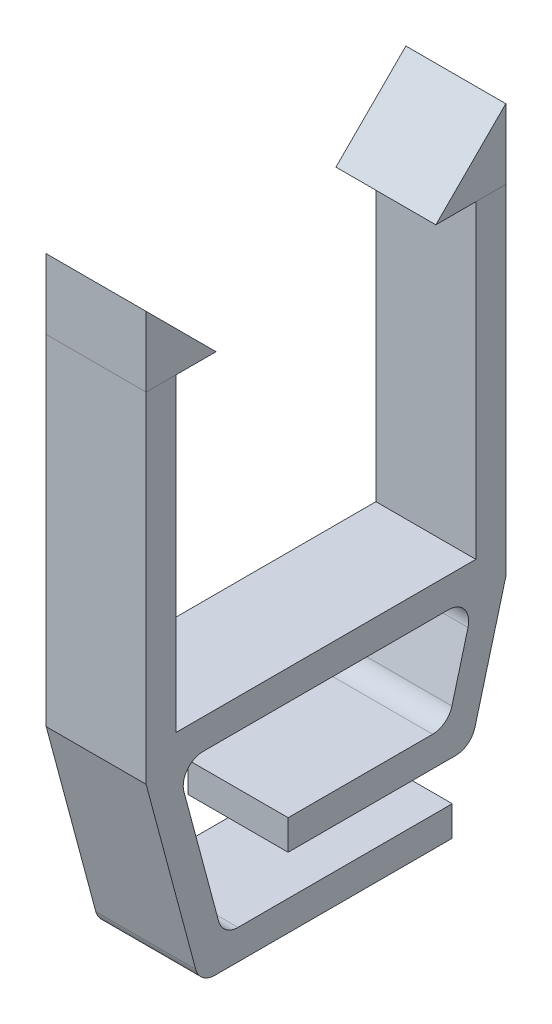
ISO-10303-21;
HEADER;
FILE_DESCRIPTION(('STEP AP214'),'2;1');
FILE_NAME('part.step','',(''),(''),'','','');
FILE_SCHEMA(('AUTOMOTIVE_DESIGN { 1 0 10303 214 1 1 1 1 }'));
ENDSEC;
DATA;
#1=APPLICATION_CONTEXT('core data for automotive mechanical design processes');
#2=APPLICATION_PROTOCOL_DEFINITION('international standard','automotive_design',2000,#1);
#3=PRODUCT_CONTEXT('',#1,'mechanical');
#4=PRODUCT('Part','Part','',(#3));
#5=PRODUCT_RELATED_PRODUCT_CATEGORY('part','',(#4));
#6=PRODUCT_DEFINITION_FORMATION('','',#4);
#7=PRODUCT_DEFINITION_CONTEXT('part definition',#1,'design');
#8=PRODUCT_DEFINITION('design','',#6,#7);
#9=PRODUCT_DEFINITION_SHAPE('','',#8);
#10=(LENGTH_UNIT() NAMED_UNIT(*) SI_UNIT(.MILLI.,.METRE.));
#11=(NAMED_UNIT(*) PLANE_ANGLE_UNIT() SI_UNIT($,.RADIAN.));
#12=(NAMED_UNIT(*) SI_UNIT($,.STERADIAN.) SOLID_ANGLE_UNIT());
#13=UNCERTAINTY_MEASURE_WITH_UNIT(LENGTH_MEASURE(1.E-05),#10,'distance_accuracy_value','');
#14=(GEOMETRIC_REPRESENTATION_CONTEXT(3) GLOBAL_UNCERTAINTY_ASSIGNED_CONTEXT((#13)) GLOBAL_UNIT_ASSIGNED_CONTEXT((#10,
#11,#12)) REPRESENTATION_CONTEXT('',''));
#15=CARTESIAN_POINT('',(0.,0.,0.));
#16=DIRECTION('',(0.,0.,1.));
#17=DIRECTION('',(1.,0.,0.));
#18=AXIS2_PLACEMENT_3D('',#15,#16,#17);
#19=CARTESIAN_POINT('',(-10.9756097560976,15.5,5.45121951219512));
#20=DIRECTION('',(0.,-1.,0.));
#21=DIRECTION('',(0.,0.,-1.));
#22=AXIS2_PLACEMENT_3D('',#19,#20,#21);
#23=PLANE('',#22);
#24=DIRECTION('',(0.,0.,-1.));
#25=VECTOR('',#24,1.);
#26=CARTESIAN_POINT('',(-5.97560975609756,15.5,5.45121951219512));
#27=LINE('',#26,#25);
#28=CARTESIAN_POINT('',(-5.97560975609756,15.5,8.95121951219512));
#29=VERTEX_POINT('',#28);
#30=CARTESIAN_POINT('',(-5.97560975609756,15.5,5.45121951219512));
#31=VERTEX_POINT('',#30);
#32=EDGE_CURVE('E100',#29,#31,#27,.T.);
#33=ORIENTED_EDGE('',*,*,#32,.F.);
#34=DIRECTION('',(1.,0.,0.));
#35=VECTOR('',#34,1.);
#36=CARTESIAN_POINT('',(-10.9756097560976,15.5,8.95121951219512));
#37=LINE('',#36,#35);
#38=CARTESIAN_POINT('',(-10.9756097560976,15.5,8.95121951219512));
#39=VERTEX_POINT('',#38);
#40=EDGE_CURVE('E12',#39,#29,#37,.T.);
#41=ORIENTED_EDGE('',*,*,#40,.F.);
#42=DIRECTION('',(0.,0.,-1.));
#43=VECTOR('',#42,1.);
#44=CARTESIAN_POINT('',(-10.9756097560976,15.5,5.45121951219512));
#45=LINE('',#44,#43);
#46=CARTESIAN_POINT('',(-10.9756097560976,15.5,5.45121951219512));
#47=VERTEX_POINT('',#46);
#48=EDGE_CURVE('E92',#39,#47,#45,.T.);
#49=ORIENTED_EDGE('',*,*,#48,.T.);
#50=DIRECTION('',(1.,0.,0.));
#51=VECTOR('',#50,1.);
#52=CARTESIAN_POINT('',(-10.9756097560976,15.5,5.45121951219512));
#53=LINE('',#52,#51);
#54=EDGE_CURVE('E51',#47,#31,#53,.T.);
#55=ORIENTED_EDGE('',*,*,#54,.T.);
#56=EDGE_LOOP('',(#33,#41,#49,#55));
#57=FACE_BOUND('',#56,.T.);
#58=ADVANCED_FACE('F48',(#57),#23,.T.);
#59=CARTESIAN_POINT('',(-10.9756097560976,15.5,8.95121951219512));
#60=DIRECTION('',(0.,0.,1.));
#61=DIRECTION('',(1.,0.,0.));
#62=AXIS2_PLACEMENT_3D('',#59,#60,#61);
#63=PLANE('',#62);
#64=DIRECTION('',(0.,-1.,0.));
#65=VECTOR('',#64,1.);
#66=CARTESIAN_POINT('',(-5.97560975609756,15.5,8.95121951219512));
#67=LINE('',#66,#65);
#68=CARTESIAN_POINT('',(-5.97560975609756,19.,8.95121951219512));
#69=VERTEX_POINT('',#68);
#70=EDGE_CURVE('E94',#69,#29,#67,.T.);
#71=ORIENTED_EDGE('',*,*,#70,.F.);
#72=DIRECTION('',(1.,0.,0.));
#73=VECTOR('',#72,1.);
#74=CARTESIAN_POINT('',(-10.9756097560976,19.,8.95121951219512));
#75=LINE('',#74,#73);
#76=CARTESIAN_POINT('',(-10.9756097560976,19.,8.95121951219512));
#77=VERTEX_POINT('',#76);
#78=EDGE_CURVE('E57',#77,#69,#75,.T.);
#79=ORIENTED_EDGE('',*,*,#78,.F.);
#80=DIRECTION('',(0.,-1.,0.));
#81=VECTOR('',#80,1.);
#82=CARTESIAN_POINT('',(-10.9756097560976,15.5,8.95121951219512));
#83=LINE('',#82,#81);
#84=EDGE_CURVE('E89',#77,#39,#83,.T.);
#85=ORIENTED_EDGE('',*,*,#84,.T.);
#86=ORIENTED_EDGE('',*,*,#40,.T.);
#87=EDGE_LOOP('',(#71,#79,#85,#86));
#88=FACE_BOUND('',#87,.T.);
#89=ADVANCED_FACE('F104',(#88),#63,.T.);
#90=CARTESIAN_POINT('',(-10.9756097560976,19.,8.95121951219512));
#91=DIRECTION('',(0.,0.707106781186548,-0.707106781186548));
#92=DIRECTION('',(0.,0.707106781186548,0.707106781186548));
#93=AXIS2_PLACEMENT_3D('',#90,#91,#92);
#94=PLANE('',#93);
#95=DIRECTION('',(0.,0.707106781186547,0.707106781186547));
#96=VECTOR('',#95,1.);
#97=CARTESIAN_POINT('',(-5.97560975609756,19.,8.95121951219512));
#98=LINE('',#97,#96);
#99=EDGE_CURVE('E87',#31,#69,#98,.T.);
#100=ORIENTED_EDGE('',*,*,#99,.F.);
#101=ORIENTED_EDGE('',*,*,#54,.F.);
#102=DIRECTION('',(0.,0.707106781186547,0.707106781186547));
#103=VECTOR('',#102,1.);
#104=CARTESIAN_POINT('',(-10.9756097560976,19.,8.95121951219512));
#105=LINE('',#104,#103);
#106=EDGE_CURVE('E85',#47,#77,#105,.T.);
#107=ORIENTED_EDGE('',*,*,#106,.T.);
#108=ORIENTED_EDGE('',*,*,#78,.T.);
#109=EDGE_LOOP('',(#100,#101,#107,#108));
#110=FACE_BOUND('',#109,.T.);
#111=ADVANCED_FACE('F84',(#110),#94,.T.);
#112=CARTESIAN_POINT('',(-10.9756097560976,0.,0.));
#113=DIRECTION('',(-1.,0.,0.));
#114=DIRECTION('',(0.,0.,1.));
#115=AXIS2_PLACEMENT_3D('',#112,#113,#114);
#116=PLANE('',#115);
#117=ORIENTED_EDGE('',*,*,#48,.F.);
#118=ORIENTED_EDGE('',*,*,#84,.F.);
#119=ORIENTED_EDGE('',*,*,#106,.F.);
#120=EDGE_LOOP('',(#117,#118,#119));
#121=FACE_BOUND('',#120,.T.);
#122=ADVANCED_FACE('F91',(#121),#116,.T.);
#123=CARTESIAN_POINT('',(-5.97560975609756,0.,0.));
#124=DIRECTION('',(-1.,0.,0.));
#125=DIRECTION('',(0.,0.,1.));
#126=AXIS2_PLACEMENT_3D('',#123,#124,#125);
#127=PLANE('',#126);
#128=ORIENTED_EDGE('',*,*,#32,.T.);
#129=ORIENTED_EDGE('',*,*,#99,.T.);
#130=ORIENTED_EDGE('',*,*,#70,.T.);
#131=EDGE_LOOP('',(#128,#129,#130));
#132=FACE_BOUND('',#131,.T.);
#133=ADVANCED_FACE('F103',(#132),#127,.F.);
#134=CLOSED_SHELL('',(#58,#89,#111,#122,#133));
#135=MANIFOLD_SOLID_BREP('B2',#134);
#136=CARTESIAN_POINT('',(-10.9756097560976,15.5,-5.54878048780488));
#137=DIRECTION('',(0.,-1.,0.));
#138=DIRECTION('',(0.,0.,-1.));
#139=AXIS2_PLACEMENT_3D('',#136,#137,#138);
#140=PLANE('',#139);
#141=DIRECTION('',(0.,0.,-1.));
#142=VECTOR('',#141,1.);
#143=CARTESIAN_POINT('',(-5.97560975609756,15.5,-5.54878048780488));
#144=LINE('',#143,#142);
#145=CARTESIAN_POINT('',(-5.97560975609756,15.5,-5.54878048780488));
#146=VERTEX_POINT('',#145);
#147=CARTESIAN_POINT('',(-5.97560975609756,15.5,-9.04878048780488));
#148=VERTEX_POINT('',#147);
#149=EDGE_CURVE('E207',#146,#148,#144,.T.);
#150=ORIENTED_EDGE('',*,*,#149,.F.);
#151=DIRECTION('',(1.,0.,0.));
#152=VECTOR('',#151,1.);
#153=CARTESIAN_POINT('',(-10.9756097560976,15.5,-5.54878048780488));
#154=LINE('',#153,#152);
#155=CARTESIAN_POINT('',(-10.9756097560976,15.5,-5.54878048780488));
#156=VERTEX_POINT('',#155);
#157=EDGE_CURVE('E46',#156,#146,#154,.T.);
#158=ORIENTED_EDGE('',*,*,#157,.F.);
#159=DIRECTION('',(0.,0.,-1.));
#160=VECTOR('',#159,1.);
#161=CARTESIAN_POINT('',(-10.9756097560976,15.5,-5.54878048780488));
#162=LINE('',#161,#160);
#163=CARTESIAN_POINT('',(-10.9756097560976,15.5,-9.04878048780488));
#164=VERTEX_POINT('',#163);
#165=EDGE_CURVE('E199',#156,#164,#162,.T.);
#166=ORIENTED_EDGE('',*,*,#165,.T.);
#167=DIRECTION('',(1.,0.,0.));
#168=VECTOR('',#167,1.);
#169=CARTESIAN_POINT('',(-10.9756097560976,15.5,-9.04878048780488));
#170=LINE('',#169,#168);
#171=EDGE_CURVE('E158',#164,#148,#170,.T.);
#172=ORIENTED_EDGE('',*,*,#171,.T.);
#173=EDGE_LOOP('',(#150,#158,#166,#172));
#174=FACE_BOUND('',#173,.T.);
#175=ADVANCED_FACE('F155',(#174),#140,.T.);
#176=CARTESIAN_POINT('',(-10.9756097560976,19.,-9.04878048780488));
#177=DIRECTION('',(0.,0.707106781186548,0.707106781186547));
#178=DIRECTION('',(0.,-0.707106781186547,0.707106781186548));
#179=AXIS2_PLACEMENT_3D('',#176,#177,#178);
#180=PLANE('',#179);
#181=DIRECTION('',(0.,-0.707106781186547,0.707106781186548));
#182=VECTOR('',#181,1.);
#183=CARTESIAN_POINT('',(-5.97560975609756,19.,-9.04878048780489));
#184=LINE('',#183,#182);
#185=CARTESIAN_POINT('',(-5.97560975609756,19.,-9.04878048780489));
#186=VERTEX_POINT('',#185);
#187=EDGE_CURVE('E201',#186,#146,#184,.T.);
#188=ORIENTED_EDGE('',*,*,#187,.F.);
#189=DIRECTION('',(1.,0.,0.));
#190=VECTOR('',#189,1.);
#191=CARTESIAN_POINT('',(-10.9756097560976,19.,-9.04878048780488));
#192=LINE('',#191,#190);
#193=CARTESIAN_POINT('',(-10.9756097560976,19.,-9.04878048780488));
#194=VERTEX_POINT('',#193);
#195=EDGE_CURVE('E164',#194,#186,#192,.T.);
#196=ORIENTED_EDGE('',*,*,#195,.F.);
#197=DIRECTION('',(0.,-0.707106781186547,0.707106781186548));
#198=VECTOR('',#197,1.);
#199=CARTESIAN_POINT('',(-10.9756097560976,19.,-9.04878048780488));
#200=LINE('',#199,#198);
#201=EDGE_CURVE('E196',#194,#156,#200,.T.);
#202=ORIENTED_EDGE('',*,*,#201,.T.);
#203=ORIENTED_EDGE('',*,*,#157,.T.);
#204=EDGE_LOOP('',(#188,#196,#202,#203));
#205=FACE_BOUND('',#204,.T.);
#206=ADVANCED_FACE('F211',(#205),#180,.T.);
#207=CARTESIAN_POINT('',(-10.9756097560976,15.5,-9.04878048780488));
#208=DIRECTION('',(0.,0.,-1.));
#209=DIRECTION('',(0.,1.,0.));
#210=AXIS2_PLACEMENT_3D('',#207,#208,#209);
#211=PLANE('',#210);
#212=DIRECTION('',(0.,1.,0.));
#213=VECTOR('',#212,1.);
#214=CARTESIAN_POINT('',(-5.97560975609756,15.5,-9.04878048780488));
#215=LINE('',#214,#213);
#216=EDGE_CURVE('E194',#148,#186,#215,.T.);
#217=ORIENTED_EDGE('',*,*,#216,.F.);
#218=ORIENTED_EDGE('',*,*,#171,.F.);
#219=DIRECTION('',(0.,1.,0.));
#220=VECTOR('',#219,1.);
#221=CARTESIAN_POINT('',(-10.9756097560976,15.5,-9.04878048780488));
#222=LINE('',#221,#220);
#223=EDGE_CURVE('E192',#164,#194,#222,.T.);
#224=ORIENTED_EDGE('',*,*,#223,.T.);
#225=ORIENTED_EDGE('',*,*,#195,.T.);
#226=EDGE_LOOP('',(#217,#218,#224,#225));
#227=FACE_BOUND('',#226,.T.);
#228=ADVANCED_FACE('F191',(#227),#211,.T.);
#229=CARTESIAN_POINT('',(-10.9756097560976,0.,0.));
#230=DIRECTION('',(1.,0.,0.));
#231=DIRECTION('',(0.,0.,-1.));
#232=AXIS2_PLACEMENT_3D('',#229,#230,#231);
#233=PLANE('',#232);
#234=ORIENTED_EDGE('',*,*,#165,.F.);
#235=ORIENTED_EDGE('',*,*,#201,.F.);
#236=ORIENTED_EDGE('',*,*,#223,.F.);
#237=EDGE_LOOP('',(#234,#235,#236));
#238=FACE_BOUND('',#237,.T.);
#239=ADVANCED_FACE('F198',(#238),#233,.F.);
#240=CARTESIAN_POINT('',(-5.97560975609756,0.,0.));
#241=DIRECTION('',(1.,0.,0.));
#242=DIRECTION('',(0.,0.,-1.));
#243=AXIS2_PLACEMENT_3D('',#240,#241,#242);
#244=PLANE('',#243);
#245=ORIENTED_EDGE('',*,*,#149,.T.);
#246=ORIENTED_EDGE('',*,*,#216,.T.);
#247=ORIENTED_EDGE('',*,*,#187,.T.);
#248=EDGE_LOOP('',(#245,#246,#247));
#249=FACE_BOUND('',#248,.T.);
#250=ADVANCED_FACE('F210',(#249),#244,.T.);
#251=CLOSED_SHELL('',(#175,#206,#228,#239,#250));
#252=MANIFOLD_SOLID_BREP('B6',#251);
#253=CARTESIAN_POINT('',(0.,-1.5,0.));
#254=DIRECTION('',(0.,1.,0.));
#255=DIRECTION('',(0.,0.,1.));
#256=AXIS2_PLACEMENT_3D('',#253,#254,#255);
#257=PLANE('',#256);
#258=DIRECTION('',(0.,0.,1.));
#259=VECTOR('',#258,1.);
#260=CARTESIAN_POINT('',(-5.97560975609756,-1.5,8.95121951219512));
#261=LINE('',#260,#259);
#262=CARTESIAN_POINT('',(-5.97560975609755,-1.5,-6.19264084434854));
#263=VERTEX_POINT('',#262);
#264=CARTESIAN_POINT('',(-5.97560975609756,-1.5,6.09507986873879));
#265=VERTEX_POINT('',#264);
#266=EDGE_CURVE('E509',#263,#265,#261,.T.);
#267=ORIENTED_EDGE('',*,*,#266,.T.);
#268=DIRECTION('',(1.,0.,0.));
#269=VECTOR('',#268,1.);
#270=CARTESIAN_POINT('',(0.,-1.5,6.09507986873879));
#271=LINE('',#270,#269);
#272=CARTESIAN_POINT('',(-10.9756097560976,-1.5,6.09507986873879));
#273=VERTEX_POINT('',#272);
#274=EDGE_CURVE('E590',#265,#273,#271,.F.);
#275=ORIENTED_EDGE('',*,*,#274,.T.);
#276=DIRECTION('',(0.,0.,-1.));
#277=VECTOR('',#276,1.);
#278=CARTESIAN_POINT('',(-10.9756097560976,-1.5,8.95121951219512));
#279=LINE('',#278,#277);
#280=CARTESIAN_POINT('',(-10.9756097560976,-1.5,-6.19264084434854));
#281=VERTEX_POINT('',#280);
#282=EDGE_CURVE('E516',#273,#281,#279,.T.);
#283=ORIENTED_EDGE('',*,*,#282,.T.);
#284=DIRECTION('',(1.,0.,0.));
#285=VECTOR('',#284,1.);
#286=CARTESIAN_POINT('',(0.,-1.5,-6.19264084434855));
#287=LINE('',#286,#285);
#288=EDGE_CURVE('E587',#281,#263,#287,.T.);
#289=ORIENTED_EDGE('',*,*,#288,.T.);
#290=EDGE_LOOP('',(#267,#275,#283,#289));
#291=FACE_BOUND('',#290,.T.);
#292=ADVANCED_FACE('F253',(#291),#257,.F.);
#293=CARTESIAN_POINT('',(-10.9756097560976,15.5,0.));
#294=DIRECTION('',(1.,0.,0.));
#295=DIRECTION('',(0.,0.,-1.));
#296=AXIS2_PLACEMENT_3D('',#293,#294,#295);
#297=PLANE('',#296);
#298=DIRECTION('',(0.,0.,-1.));
#299=VECTOR('',#298,1.);
#300=CARTESIAN_POINT('',(-10.9756097560976,-11.5,6.27172758788392));
#301=LINE('',#300,#299);
#302=CARTESIAN_POINT('',(-10.9756097560976,-11.5,5.50440059990496));
#303=VERTEX_POINT('',#302);
#304=CARTESIAN_POINT('',(-10.9756097560976,-11.5,-6.36928856349361));
#305=VERTEX_POINT('',#304);
#306=EDGE_CURVE('E462',#303,#305,#301,.T.);
#307=ORIENTED_EDGE('',*,*,#306,.F.);
#308=CARTESIAN_POINT('',(-10.9756097560976,-10.5,5.50440059990496));
#309=DIRECTION('',(1.,0.,0.));
#310=DIRECTION('',(0.,0.,-1.));
#311=AXIS2_PLACEMENT_3D('',#308,#309,#310);
#312=CIRCLE('',#311,1.);
#313=CARTESIAN_POINT('',(-10.9756097560976,-10.7588190451025,6.47032642619403));
#314=VERTEX_POINT('',#313);
#315=EDGE_CURVE('E566',#303,#314,#312,.F.);
#316=ORIENTED_EDGE('',*,*,#315,.T.);
#317=DIRECTION('',(0.,-0.965925826289069,-0.258819045102518));
#318=VECTOR('',#317,1.);
#319=CARTESIAN_POINT('',(-10.9756097560976,-1.5,8.95121951219512));
#320=LINE('',#319,#318);
#321=CARTESIAN_POINT('',(-10.9756097560976,-1.5,8.95121951219512));
#322=VERTEX_POINT('',#321);
#323=EDGE_CURVE('E459',#322,#314,#320,.T.);
#324=ORIENTED_EDGE('',*,*,#323,.F.);
#325=DIRECTION('',(0.,1.,0.));
#326=VECTOR('',#325,1.);
#327=CARTESIAN_POINT('',(-10.9756097560976,-1.5,8.95121951219512));
#328=LINE('',#327,#326);
#329=CARTESIAN_POINT('',(-10.9756097560976,15.5,8.95121951219512));
#330=VERTEX_POINT('',#329);
#331=EDGE_CURVE('E522',#322,#330,#328,.T.);
#332=ORIENTED_EDGE('',*,*,#331,.T.);
#333=DIRECTION('',(0.,0.,1.));
#334=VECTOR('',#333,1.);
#335=CARTESIAN_POINT('',(-10.9756097560976,15.5,0.));
#336=LINE('',#335,#334);
#337=CARTESIAN_POINT('',(-10.9756097560976,15.5,7.45121951219512));
#338=VERTEX_POINT('',#337);
#339=EDGE_CURVE('E493',#338,#330,#336,.T.);
#340=ORIENTED_EDGE('',*,*,#339,.F.);
#341=DIRECTION('',(0.,-1.,0.));
#342=VECTOR('',#341,1.);
#343=CARTESIAN_POINT('',(-10.9756097560976,15.5,7.45121951219512));
#344=LINE('',#343,#342);
#345=CARTESIAN_POINT('',(-10.9756097560976,0.,7.45121951219512));
#346=VERTEX_POINT('',#345);
#347=EDGE_CURVE('E506',#338,#346,#344,.T.);
#348=ORIENTED_EDGE('',*,*,#347,.T.);
#349=DIRECTION('',(0.,0.,-1.));
#350=VECTOR('',#349,1.);
#351=CARTESIAN_POINT('',(-10.9756097560976,0.,8.95121951219512));
#352=LINE('',#351,#350);
#353=CARTESIAN_POINT('',(-10.9756097560976,0.,-7.54878048780489));
#354=VERTEX_POINT('',#353);
#355=EDGE_CURVE('E513',#346,#354,#352,.T.);
#356=ORIENTED_EDGE('',*,*,#355,.T.);
#357=DIRECTION('',(0.,-1.,0.));
#358=VECTOR('',#357,1.);
#359=CARTESIAN_POINT('',(-10.9756097560976,15.5,-7.54878048780488));
#360=LINE('',#359,#358);
#361=CARTESIAN_POINT('',(-10.9756097560976,15.5,-7.54878048780488));
#362=VERTEX_POINT('',#361);
#363=EDGE_CURVE('E552',#362,#354,#360,.T.);
#364=ORIENTED_EDGE('',*,*,#363,.F.);
#365=DIRECTION('',(0.,0.,1.));
#366=VECTOR('',#365,1.);
#367=CARTESIAN_POINT('',(-10.9756097560976,15.5,0.));
#368=LINE('',#367,#366);
#369=CARTESIAN_POINT('',(-10.9756097560976,15.5,-9.04878048780488));
#370=VERTEX_POINT('',#369);
#371=EDGE_CURVE('E530',#370,#362,#368,.T.);
#372=ORIENTED_EDGE('',*,*,#371,.F.);
#373=DIRECTION('',(0.,-1.,0.));
#374=VECTOR('',#373,1.);
#375=CARTESIAN_POINT('',(-10.9756097560976,15.5,-9.04878048780488));
#376=LINE('',#375,#374);
#377=CARTESIAN_POINT('',(-10.9756097560976,-1.5,-9.04878048780488));
#378=VERTEX_POINT('',#377);
#379=EDGE_CURVE('E541',#370,#378,#376,.T.);
#380=ORIENTED_EDGE('',*,*,#379,.T.);
#381=DIRECTION('',(0.,0.965925826289067,-0.258819045102524));
#382=VECTOR('',#381,1.);
#383=CARTESIAN_POINT('',(-10.9756097560976,-1.5,-9.04878048780488));
#384=LINE('',#383,#382);
#385=CARTESIAN_POINT('',(-10.9756097560976,-7.25881904510253,-7.50570957531266));
#386=VERTEX_POINT('',#385);
#387=EDGE_CURVE('E434',#386,#378,#384,.T.);
#388=ORIENTED_EDGE('',*,*,#387,.F.);
#389=CARTESIAN_POINT('',(-10.9756097560976,-7.,-6.5397837490236));
#390=DIRECTION('',(1.,0.,0.));
#391=DIRECTION('',(0.,0.,-1.));
#392=AXIS2_PLACEMENT_3D('',#389,#390,#391);
#393=CIRCLE('',#392,1.);
#394=CARTESIAN_POINT('',(-10.9756097560976,-8.,-6.5397837490236));
#395=VERTEX_POINT('',#394);
#396=EDGE_CURVE('E564',#386,#395,#393,.F.);
#397=ORIENTED_EDGE('',*,*,#396,.T.);
#398=DIRECTION('',(0.,0.,-1.));
#399=VECTOR('',#398,1.);
#400=CARTESIAN_POINT('',(-10.9756097560976,-8.,-7.30711073700255));
#401=LINE('',#400,#399);
#402=CARTESIAN_POINT('',(-10.9756097560976,-8.,1.84387974496588));
#403=VERTEX_POINT('',#402);
#404=EDGE_CURVE('E440',#403,#395,#401,.T.);
#405=ORIENTED_EDGE('',*,*,#404,.F.);
#406=DIRECTION('',(0.,-1.,0.));
#407=VECTOR('',#406,1.);
#408=CARTESIAN_POINT('',(-10.9756097560976,-8.,1.84387974496588));
#409=LINE('',#408,#407);
#410=CARTESIAN_POINT('',(-10.9756097560976,-6.5,1.84387974496588));
#411=VERTEX_POINT('',#410);
#412=EDGE_CURVE('E425',#411,#403,#409,.T.);
#413=ORIENTED_EDGE('',*,*,#412,.F.);
#414=DIRECTION('',(0.,0.,1.));
#415=VECTOR('',#414,1.);
#416=CARTESIAN_POINT('',(-10.9756097560976,-6.5,1.84387974496588));
#417=LINE('',#416,#415);
#418=CARTESIAN_POINT('',(-10.9756097560976,-6.5,-5.38879326705516));
#419=VERTEX_POINT('',#418);
#420=EDGE_CURVE('E415',#419,#411,#417,.T.);
#421=ORIENTED_EDGE('',*,*,#420,.F.);
#422=CARTESIAN_POINT('',(-10.9756097560976,-5.5,-5.38879326705516));
#423=DIRECTION('',(1.,0.,0.));
#424=DIRECTION('',(0.,0.,-1.));
#425=AXIS2_PLACEMENT_3D('',#422,#423,#424);
#426=CIRCLE('',#425,1.);
#427=CARTESIAN_POINT('',(-10.9756097560976,-5.75881904510253,-6.35471909334423));
#428=VERTEX_POINT('',#427);
#429=EDGE_CURVE('E597',#419,#428,#426,.T.);
#430=ORIENTED_EDGE('',*,*,#429,.T.);
#431=DIRECTION('',(0.,-0.965925826289067,0.258819045102525));
#432=VECTOR('',#431,1.);
#433=CARTESIAN_POINT('',(-10.9756097560976,-6.5,-6.15612025503412));
#434=LINE('',#433,#432);
#435=CARTESIAN_POINT('',(-10.9756097560976,-2.75881904510252,-7.15856667063761));
#436=VERTEX_POINT('',#435);
#437=EDGE_CURVE('E426',#436,#428,#434,.T.);
#438=ORIENTED_EDGE('',*,*,#437,.F.);
#439=CARTESIAN_POINT('',(-10.9756097560976,-2.5,-6.19264084434854));
#440=DIRECTION('',(1.,0.,0.));
#441=DIRECTION('',(0.,0.,-1.));
#442=AXIS2_PLACEMENT_3D('',#439,#440,#441);
#443=CIRCLE('',#442,1.);
#444=EDGE_CURVE('E153',#436,#281,#443,.T.);
#445=ORIENTED_EDGE('',*,*,#444,.T.);
#446=ORIENTED_EDGE('',*,*,#282,.F.);
#447=CARTESIAN_POINT('',(-10.9756097560976,-2.5,6.09507986873879));
#448=DIRECTION('',(1.,0.,0.));
#449=DIRECTION('',(0.,0.,-1.));
#450=AXIS2_PLACEMENT_3D('',#447,#448,#449);
#451=CIRCLE('',#450,1.);
#452=CARTESIAN_POINT('',(-10.9756097560976,-2.75881904510252,7.06100569502786));
#453=VERTEX_POINT('',#452);
#454=EDGE_CURVE('E274',#273,#453,#451,.T.);
#455=ORIENTED_EDGE('',*,*,#454,.T.);
#456=DIRECTION('',(0.,0.965925826289069,0.258819045102518));
#457=VECTOR('',#456,1.);
#458=CARTESIAN_POINT('',(-10.9756097560976,-10.,5.12073710591548));
#459=LINE('',#458,#457);
#460=CARTESIAN_POINT('',(-10.9756097560976,-9.25881904510252,5.31933594422558));
#461=VERTEX_POINT('',#460);
#462=EDGE_CURVE('E470',#461,#453,#459,.T.);
#463=ORIENTED_EDGE('',*,*,#462,.F.);
#464=CARTESIAN_POINT('',(-10.9756097560976,-9.,4.35341011793651));
#465=DIRECTION('',(1.,0.,0.));
#466=DIRECTION('',(0.,0.,-1.));
#467=AXIS2_PLACEMENT_3D('',#464,#465,#466);
#468=CIRCLE('',#467,1.);
#469=CARTESIAN_POINT('',(-10.9756097560976,-10.,4.35341011793651));
#470=VERTEX_POINT('',#469);
#471=EDGE_CURVE('E268',#461,#470,#468,.T.);
#472=ORIENTED_EDGE('',*,*,#471,.T.);
#473=DIRECTION('',(0.,0.,1.));
#474=VECTOR('',#473,1.);
#475=CARTESIAN_POINT('',(-10.9756097560976,-10.,-6.36928856349361));
#476=LINE('',#475,#474);
#477=CARTESIAN_POINT('',(-10.9756097560976,-10.,-6.36928856349361));
#478=VERTEX_POINT('',#477);
#479=EDGE_CURVE('E468',#478,#470,#476,.T.);
#480=ORIENTED_EDGE('',*,*,#479,.F.);
#481=DIRECTION('',(0.,1.,0.));
#482=VECTOR('',#481,1.);
#483=CARTESIAN_POINT('',(-10.9756097560976,-11.5,-6.36928856349361));
#484=LINE('',#483,#482);
#485=EDGE_CURVE('E465',#305,#478,#484,.T.);
#486=ORIENTED_EDGE('',*,*,#485,.F.);
#487=EDGE_LOOP('',(#307,#316,#324,#332,#340,#348,#356,#364,#372,#380,#388,#397,#405,#413,#421,
#430,#438,#445,#446,#455,#463,#472,#480,#486));
#488=FACE_BOUND('',#487,.T.);
#489=ADVANCED_FACE('F438',(#488),#297,.F.);
#490=CARTESIAN_POINT('',(0.,15.5,-7.54878048780488));
#491=DIRECTION('',(0.,0.,-1.));
#492=DIRECTION('',(-1.,0.,0.));
#493=AXIS2_PLACEMENT_3D('',#490,#491,#492);
#494=PLANE('',#493);
#495=DIRECTION('',(1.,0.,0.));
#496=VECTOR('',#495,1.);
#497=CARTESIAN_POINT('',(0.,0.,-7.54878048780488));
#498=LINE('',#497,#496);
#499=CARTESIAN_POINT('',(-5.97560975609756,0.,-7.54878048780488));
#500=VERTEX_POINT('',#499);
#501=EDGE_CURVE('E529',#354,#500,#498,.T.);
#502=ORIENTED_EDGE('',*,*,#501,.T.);
#503=DIRECTION('',(0.,-1.,0.));
#504=VECTOR('',#503,1.);
#505=CARTESIAN_POINT('',(-5.97560975609756,15.5,-7.54878048780488));
#506=LINE('',#505,#504);
#507=CARTESIAN_POINT('',(-5.97560975609756,15.5,-7.54878048780488));
#508=VERTEX_POINT('',#507);
#509=EDGE_CURVE('E549',#508,#500,#506,.T.);
#510=ORIENTED_EDGE('',*,*,#509,.F.);
#511=DIRECTION('',(1.,0.,0.));
#512=VECTOR('',#511,1.);
#513=CARTESIAN_POINT('',(0.,15.5,-7.54878048780488));
#514=LINE('',#513,#512);
#515=EDGE_CURVE('E533',#362,#508,#514,.T.);
#516=ORIENTED_EDGE('',*,*,#515,.F.);
#517=ORIENTED_EDGE('',*,*,#363,.T.);
#518=EDGE_LOOP('',(#502,#510,#516,#517));
#519=FACE_BOUND('',#518,.T.);
#520=ADVANCED_FACE('F665',(#519),#494,.F.);
#521=CARTESIAN_POINT('',(-5.97560975609756,15.5,0.));
#522=DIRECTION('',(1.,0.,0.));
#523=DIRECTION('',(0.,0.,-1.));
#524=AXIS2_PLACEMENT_3D('',#521,#522,#523);
#525=PLANE('',#524);
#526=DIRECTION('',(0.,-0.965925826289069,-0.258819045102518));
#527=VECTOR('',#526,1.);
#528=CARTESIAN_POINT('',(-5.97560975609756,-1.5,8.95121951219512));
#529=LINE('',#528,#527);
#530=CARTESIAN_POINT('',(-5.97560975609756,-1.5,8.95121951219512));
#531=VERTEX_POINT('',#530);
#532=CARTESIAN_POINT('',(-5.97560975609756,-10.7588190451025,6.47032642619403));
#533=VERTEX_POINT('',#532);
#534=EDGE_CURVE('E457',#531,#533,#529,.T.);
#535=ORIENTED_EDGE('',*,*,#534,.T.);
#536=CARTESIAN_POINT('',(-5.97560975609756,-10.5,5.50440059990496));
#537=DIRECTION('',(1.,0.,0.));
#538=DIRECTION('',(0.,0.,-1.));
#539=AXIS2_PLACEMENT_3D('',#536,#537,#538);
#540=CIRCLE('',#539,1.);
#541=CARTESIAN_POINT('',(-5.97560975609756,-11.5,5.50440059990496));
#542=VERTEX_POINT('',#541);
#543=EDGE_CURVE('E560',#533,#542,#540,.T.);
#544=ORIENTED_EDGE('',*,*,#543,.T.);
#545=DIRECTION('',(0.,0.,-1.));
#546=VECTOR('',#545,1.);
#547=CARTESIAN_POINT('',(-5.97560975609756,-11.5,6.27172758788392));
#548=LINE('',#547,#546);
#549=CARTESIAN_POINT('',(-5.97560975609756,-11.5,-6.36928856349361));
#550=VERTEX_POINT('',#549);
#551=EDGE_CURVE('E475',#542,#550,#548,.T.);
#552=ORIENTED_EDGE('',*,*,#551,.T.);
#553=DIRECTION('',(0.,1.,0.));
#554=VECTOR('',#553,1.);
#555=CARTESIAN_POINT('',(-5.97560975609756,-11.5,-6.36928856349361));
#556=LINE('',#555,#554);
#557=CARTESIAN_POINT('',(-5.97560975609756,-10.,-6.36928856349361));
#558=VERTEX_POINT('',#557);
#559=EDGE_CURVE('E477',#550,#558,#556,.T.);
#560=ORIENTED_EDGE('',*,*,#559,.T.);
#561=DIRECTION('',(0.,0.,1.));
#562=VECTOR('',#561,1.);
#563=CARTESIAN_POINT('',(-5.97560975609756,-10.,-6.36928856349361));
#564=LINE('',#563,#562);
#565=CARTESIAN_POINT('',(-5.97560975609756,-10.,4.35341011793651));
#566=VERTEX_POINT('',#565);
#567=EDGE_CURVE('E480',#558,#566,#564,.T.);
#568=ORIENTED_EDGE('',*,*,#567,.T.);
#569=CARTESIAN_POINT('',(-5.97560975609756,-9.,4.35341011793651));
#570=DIRECTION('',(1.,0.,0.));
#571=DIRECTION('',(0.,0.,-1.));
#572=AXIS2_PLACEMENT_3D('',#569,#570,#571);
#573=CIRCLE('',#572,1.);
#574=CARTESIAN_POINT('',(-5.97560975609756,-9.25881904510252,5.31933594422558));
#575=VERTEX_POINT('',#574);
#576=EDGE_CURVE('E592',#566,#575,#573,.F.);
#577=ORIENTED_EDGE('',*,*,#576,.T.);
#578=DIRECTION('',(0.,0.965925826289069,0.258819045102518));
#579=VECTOR('',#578,1.);
#580=CARTESIAN_POINT('',(-5.97560975609756,-10.,5.12073710591548));
#581=LINE('',#580,#579);
#582=CARTESIAN_POINT('',(-5.97560975609756,-2.75881904510252,7.06100569502786));
#583=VERTEX_POINT('',#582);
#584=EDGE_CURVE('E463',#575,#583,#581,.T.);
#585=ORIENTED_EDGE('',*,*,#584,.T.);
#586=CARTESIAN_POINT('',(-5.97560975609756,-2.5,6.09507986873879));
#587=DIRECTION('',(1.,0.,0.));
#588=DIRECTION('',(0.,0.,-1.));
#589=AXIS2_PLACEMENT_3D('',#586,#587,#588);
#590=CIRCLE('',#589,1.);
#591=EDGE_CURVE('E599',#583,#265,#590,.F.);
#592=ORIENTED_EDGE('',*,*,#591,.T.);
#593=ORIENTED_EDGE('',*,*,#266,.F.);
#594=CARTESIAN_POINT('',(-5.97560975609756,-2.5,-6.19264084434854));
#595=DIRECTION('',(1.,0.,0.));
#596=DIRECTION('',(0.,0.,-1.));
#597=AXIS2_PLACEMENT_3D('',#594,#595,#596);
#598=CIRCLE('',#597,1.);
#599=CARTESIAN_POINT('',(-5.97560975609756,-2.75881904510252,-7.15856667063761));
#600=VERTEX_POINT('',#599);
#601=EDGE_CURVE('E261',#263,#600,#598,.F.);
#602=ORIENTED_EDGE('',*,*,#601,.T.);
#603=DIRECTION('',(0.,-0.965925826289067,0.258819045102525));
#604=VECTOR('',#603,1.);
#605=CARTESIAN_POINT('',(-5.97560975609756,-6.5,-6.15612025503412));
#606=LINE('',#605,#604);
#607=CARTESIAN_POINT('',(-5.97560975609756,-5.75881904510253,-6.35471909334423));
#608=VERTEX_POINT('',#607);
#609=EDGE_CURVE('E446',#600,#608,#606,.T.);
#610=ORIENTED_EDGE('',*,*,#609,.T.);
#611=CARTESIAN_POINT('',(-5.97560975609756,-5.5,-5.38879326705516));
#612=DIRECTION('',(1.,0.,0.));
#613=DIRECTION('',(0.,0.,-1.));
#614=AXIS2_PLACEMENT_3D('',#611,#612,#613);
#615=CIRCLE('',#614,1.);
#616=CARTESIAN_POINT('',(-5.97560975609756,-6.5,-5.38879326705516));
#617=VERTEX_POINT('',#616);
#618=EDGE_CURVE('E595',#608,#617,#615,.F.);
#619=ORIENTED_EDGE('',*,*,#618,.T.);
#620=DIRECTION('',(0.,0.,1.));
#621=VECTOR('',#620,1.);
#622=CARTESIAN_POINT('',(-5.97560975609756,-6.5,1.84387974496588));
#623=LINE('',#622,#621);
#624=CARTESIAN_POINT('',(-5.97560975609756,-6.5,1.84387974496588));
#625=VERTEX_POINT('',#624);
#626=EDGE_CURVE('E449',#617,#625,#623,.T.);
#627=ORIENTED_EDGE('',*,*,#626,.T.);
#628=DIRECTION('',(0.,-1.,0.));
#629=VECTOR('',#628,1.);
#630=CARTESIAN_POINT('',(-5.97560975609756,-8.,1.84387974496588));
#631=LINE('',#630,#629);
#632=CARTESIAN_POINT('',(-5.97560975609756,-8.,1.84387974496588));
#633=VERTEX_POINT('',#632);
#634=EDGE_CURVE('E432',#625,#633,#631,.T.);
#635=ORIENTED_EDGE('',*,*,#634,.T.);
#636=DIRECTION('',(0.,0.,-1.));
#637=VECTOR('',#636,1.);
#638=CARTESIAN_POINT('',(-5.97560975609756,-8.,-7.30711073700256));
#639=LINE('',#638,#637);
#640=CARTESIAN_POINT('',(-5.97560975609756,-8.,-6.5397837490236));
#641=VERTEX_POINT('',#640);
#642=EDGE_CURVE('E452',#633,#641,#639,.T.);
#643=ORIENTED_EDGE('',*,*,#642,.T.);
#644=CARTESIAN_POINT('',(-5.97560975609756,-7.,-6.5397837490236));
#645=DIRECTION('',(1.,0.,0.));
#646=DIRECTION('',(0.,0.,-1.));
#647=AXIS2_PLACEMENT_3D('',#644,#645,#646);
#648=CIRCLE('',#647,1.);
#649=CARTESIAN_POINT('',(-5.97560975609756,-7.25881904510253,-7.50570957531267));
#650=VERTEX_POINT('',#649);
#651=EDGE_CURVE('E558',#641,#650,#648,.T.);
#652=ORIENTED_EDGE('',*,*,#651,.T.);
#653=DIRECTION('',(0.,0.965925826289067,-0.258819045102524));
#654=VECTOR('',#653,1.);
#655=CARTESIAN_POINT('',(-5.97560975609756,-1.5,-9.04878048780488));
#656=LINE('',#655,#654);
#657=CARTESIAN_POINT('',(-5.97560975609756,-1.5,-9.04878048780488));
#658=VERTEX_POINT('',#657);
#659=EDGE_CURVE('E455',#650,#658,#656,.T.);
#660=ORIENTED_EDGE('',*,*,#659,.T.);
#661=DIRECTION('',(0.,-1.,0.));
#662=VECTOR('',#661,1.);
#663=CARTESIAN_POINT('',(-5.97560975609756,15.5,-9.04878048780488));
#664=LINE('',#663,#662);
#665=CARTESIAN_POINT('',(-5.97560975609756,15.5,-9.04878048780488));
#666=VERTEX_POINT('',#665);
#667=EDGE_CURVE('E546',#666,#658,#664,.T.);
#668=ORIENTED_EDGE('',*,*,#667,.F.);
#669=DIRECTION('',(0.,0.,1.));
#670=VECTOR('',#669,1.);
#671=CARTESIAN_POINT('',(-5.97560975609756,15.5,0.));
#672=LINE('',#671,#670);
#673=EDGE_CURVE('E535',#666,#508,#672,.T.);
#674=ORIENTED_EDGE('',*,*,#673,.T.);
#675=ORIENTED_EDGE('',*,*,#509,.T.);
#676=DIRECTION('',(0.,0.,1.));
#677=VECTOR('',#676,1.);
#678=CARTESIAN_POINT('',(-5.97560975609756,0.,8.95121951219512));
#679=LINE('',#678,#677);
#680=CARTESIAN_POINT('',(-5.97560975609756,0.,7.45121951219512));
#681=VERTEX_POINT('',#680);
#682=EDGE_CURVE('E508',#500,#681,#679,.T.);
#683=ORIENTED_EDGE('',*,*,#682,.T.);
#684=DIRECTION('',(0.,-1.,0.));
#685=VECTOR('',#684,1.);
#686=CARTESIAN_POINT('',(-5.97560975609756,15.5,7.45121951219512));
#687=LINE('',#686,#685);
#688=CARTESIAN_POINT('',(-5.97560975609756,15.5,7.45121951219512));
#689=VERTEX_POINT('',#688);
#690=EDGE_CURVE('E502',#689,#681,#687,.T.);
#691=ORIENTED_EDGE('',*,*,#690,.F.);
#692=DIRECTION('',(0.,0.,1.));
#693=VECTOR('',#692,1.);
#694=CARTESIAN_POINT('',(-5.97560975609756,15.5,0.));
#695=LINE('',#694,#693);
#696=CARTESIAN_POINT('',(-5.97560975609756,15.5,8.95121951219512));
#697=VERTEX_POINT('',#696);
#698=EDGE_CURVE('E499',#689,#697,#695,.T.);
#699=ORIENTED_EDGE('',*,*,#698,.T.);
#700=DIRECTION('',(0.,1.,0.));
#701=VECTOR('',#700,1.);
#702=CARTESIAN_POINT('',(-5.97560975609756,-1.5,8.95121951219512));
#703=LINE('',#702,#701);
#704=EDGE_CURVE('E527',#531,#697,#703,.T.);
#705=ORIENTED_EDGE('',*,*,#704,.F.);
#706=EDGE_LOOP('',(#535,#544,#552,#560,#568,#577,#585,#592,#593,#602,#610,#619,#627,#635,#643,
#652,#660,#668,#674,#675,#683,#691,#699,#705));
#707=FACE_BOUND('',#706,.T.);
#708=ADVANCED_FACE('F604',(#707),#525,.T.);
#709=CARTESIAN_POINT('',(0.,15.5,-9.04878048780488));
#710=DIRECTION('',(0.,0.,-1.));
#711=DIRECTION('',(-1.,0.,0.));
#712=AXIS2_PLACEMENT_3D('',#709,#710,#711);
#713=PLANE('',#712);
#714=ORIENTED_EDGE('',*,*,#667,.T.);
#715=DIRECTION('',(1.,0.,0.));
#716=VECTOR('',#715,1.);
#717=CARTESIAN_POINT('',(-5.97560975609755,-1.5,-9.04878048780488));
#718=LINE('',#717,#716);
#719=EDGE_CURVE('E519',#378,#658,#718,.T.);
#720=ORIENTED_EDGE('',*,*,#719,.F.);
#721=ORIENTED_EDGE('',*,*,#379,.F.);
#722=DIRECTION('',(1.,0.,0.));
#723=VECTOR('',#722,1.);
#724=CARTESIAN_POINT('',(0.,15.5,-9.04878048780488));
#725=LINE('',#724,#723);
#726=EDGE_CURVE('E538',#370,#666,#725,.T.);
#727=ORIENTED_EDGE('',*,*,#726,.T.);
#728=EDGE_LOOP('',(#714,#720,#721,#727));
#729=FACE_BOUND('',#728,.T.);
#730=ADVANCED_FACE('F674',(#729),#713,.T.);
#731=CARTESIAN_POINT('',(0.,15.5,0.));
#732=DIRECTION('',(0.,1.,0.));
#733=DIRECTION('',(0.,0.,1.));
#734=AXIS2_PLACEMENT_3D('',#731,#732,#733);
#735=PLANE('',#734);
#736=ORIENTED_EDGE('',*,*,#371,.T.);
#737=ORIENTED_EDGE('',*,*,#515,.T.);
#738=ORIENTED_EDGE('',*,*,#673,.F.);
#739=ORIENTED_EDGE('',*,*,#726,.F.);
#740=EDGE_LOOP('',(#736,#737,#738,#739));
#741=FACE_BOUND('',#740,.T.);
#742=ADVANCED_FACE('F672',(#741),#735,.T.);
#743=CARTESIAN_POINT('',(0.,0.,0.));
#744=DIRECTION('',(0.,1.,0.));
#745=DIRECTION('',(0.,0.,1.));
#746=AXIS2_PLACEMENT_3D('',#743,#744,#745);
#747=PLANE('',#746);
#748=DIRECTION('',(1.,0.,0.));
#749=VECTOR('',#748,1.);
#750=CARTESIAN_POINT('',(0.,0.,7.45121951219512));
#751=LINE('',#750,#749);
#752=EDGE_CURVE('E487',#346,#681,#751,.T.);
#753=ORIENTED_EDGE('',*,*,#752,.T.);
#754=ORIENTED_EDGE('',*,*,#682,.F.);
#755=ORIENTED_EDGE('',*,*,#501,.F.);
#756=ORIENTED_EDGE('',*,*,#355,.F.);
#757=EDGE_LOOP('',(#753,#754,#755,#756));
#758=FACE_BOUND('',#757,.T.);
#759=ADVANCED_FACE('F662',(#758),#747,.T.);
#760=CARTESIAN_POINT('',(-5.97560975609756,-1.5,8.95121951219512));
#761=DIRECTION('',(0.,0.,-1.));
#762=DIRECTION('',(-1.,0.,0.));
#763=AXIS2_PLACEMENT_3D('',#760,#761,#762);
#764=PLANE('',#763);
#765=ORIENTED_EDGE('',*,*,#704,.T.);
#766=DIRECTION('',(1.,0.,0.));
#767=VECTOR('',#766,1.);
#768=CARTESIAN_POINT('',(0.,15.5,8.95121951219512));
#769=LINE('',#768,#767);
#770=EDGE_CURVE('E496',#330,#697,#769,.T.);
#771=ORIENTED_EDGE('',*,*,#770,.F.);
#772=ORIENTED_EDGE('',*,*,#331,.F.);
#773=DIRECTION('',(-1.,0.,0.));
#774=VECTOR('',#773,1.);
#775=CARTESIAN_POINT('',(-5.97560975609756,-1.5,8.95121951219512));
#776=LINE('',#775,#774);
#777=EDGE_CURVE('E512',#531,#322,#776,.T.);
#778=ORIENTED_EDGE('',*,*,#777,.F.);
#779=EDGE_LOOP('',(#765,#771,#772,#778));
#780=FACE_BOUND('',#779,.T.);
#781=ADVANCED_FACE('F650',(#780),#764,.F.);
#782=CARTESIAN_POINT('',(0.,15.5,7.45121951219512));
#783=DIRECTION('',(0.,0.,-1.));
#784=DIRECTION('',(-1.,0.,0.));
#785=AXIS2_PLACEMENT_3D('',#782,#783,#784);
#786=PLANE('',#785);
#787=ORIENTED_EDGE('',*,*,#752,.F.);
#788=ORIENTED_EDGE('',*,*,#347,.F.);
#789=DIRECTION('',(1.,0.,0.));
#790=VECTOR('',#789,1.);
#791=CARTESIAN_POINT('',(0.,15.5,7.45121951219512));
#792=LINE('',#791,#790);
#793=EDGE_CURVE('E490',#338,#689,#792,.T.);
#794=ORIENTED_EDGE('',*,*,#793,.T.);
#795=ORIENTED_EDGE('',*,*,#690,.T.);
#796=EDGE_LOOP('',(#787,#788,#794,#795));
#797=FACE_BOUND('',#796,.T.);
#798=ADVANCED_FACE('F660',(#797),#786,.T.);
#799=CARTESIAN_POINT('',(0.,15.5,0.));
#800=DIRECTION('',(0.,1.,0.));
#801=DIRECTION('',(0.,0.,1.));
#802=AXIS2_PLACEMENT_3D('',#799,#800,#801);
#803=PLANE('',#802);
#804=ORIENTED_EDGE('',*,*,#793,.F.);
#805=ORIENTED_EDGE('',*,*,#339,.T.);
#806=ORIENTED_EDGE('',*,*,#770,.T.);
#807=ORIENTED_EDGE('',*,*,#698,.F.);
#808=EDGE_LOOP('',(#804,#805,#806,#807));
#809=FACE_BOUND('',#808,.T.);
#810=ADVANCED_FACE('F653',(#809),#803,.T.);
#811=CARTESIAN_POINT('',(-10.9756097560976,-10.,5.12073710591548));
#812=DIRECTION('',(0.,0.258819045102518,-0.965925826289069));
#813=DIRECTION('',(0.,0.965925826289069,0.258819045102518));
#814=AXIS2_PLACEMENT_3D('',#811,#812,#813);
#815=PLANE('',#814);
#816=ORIENTED_EDGE('',*,*,#584,.F.);
#817=DIRECTION('',(1.,0.,0.));
#818=VECTOR('',#817,1.);
#819=CARTESIAN_POINT('',(-10.9756097560976,-9.25881904510252,5.31933594422558));
#820=LINE('',#819,#818);
#821=EDGE_CURVE('E574',#575,#461,#820,.F.);
#822=ORIENTED_EDGE('',*,*,#821,.T.);
#823=ORIENTED_EDGE('',*,*,#462,.T.);
#824=DIRECTION('',(1.,0.,0.));
#825=VECTOR('',#824,1.);
#826=CARTESIAN_POINT('',(-10.9756097560976,-2.75881904510252,7.06100569502786));
#827=LINE('',#826,#825);
#828=EDGE_CURVE('E571',#453,#583,#827,.T.);
#829=ORIENTED_EDGE('',*,*,#828,.T.);
#830=EDGE_LOOP('',(#816,#822,#823,#829));
#831=FACE_BOUND('',#830,.T.);
#832=ADVANCED_FACE('F621',(#831),#815,.T.);
#833=CARTESIAN_POINT('',(-10.9756097560976,-10.,-6.36928856349361));
#834=DIRECTION('',(0.,1.,0.));
#835=DIRECTION('',(0.,0.,1.));
#836=AXIS2_PLACEMENT_3D('',#833,#834,#835);
#837=PLANE('',#836);
#838=ORIENTED_EDGE('',*,*,#479,.T.);
#839=DIRECTION('',(1.,0.,0.));
#840=VECTOR('',#839,1.);
#841=CARTESIAN_POINT('',(-5.97560975609756,-10.,4.35341011793651));
#842=LINE('',#841,#840);
#843=EDGE_CURVE('E568',#470,#566,#842,.T.);
#844=ORIENTED_EDGE('',*,*,#843,.T.);
#845=ORIENTED_EDGE('',*,*,#567,.F.);
#846=DIRECTION('',(1.,0.,0.));
#847=VECTOR('',#846,1.);
#848=CARTESIAN_POINT('',(-10.9756097560976,-10.,-6.36928856349361));
#849=LINE('',#848,#847);
#850=EDGE_CURVE('E485',#478,#558,#849,.T.);
#851=ORIENTED_EDGE('',*,*,#850,.F.);
#852=EDGE_LOOP('',(#838,#844,#845,#851));
#853=FACE_BOUND('',#852,.T.);
#854=ADVANCED_FACE('F628',(#853),#837,.T.);
#855=CARTESIAN_POINT('',(-10.9756097560976,-11.5,-6.36928856349361));
#856=DIRECTION('',(0.,0.,-1.));
#857=DIRECTION('',(0.,1.,0.));
#858=AXIS2_PLACEMENT_3D('',#855,#856,#857);
#859=PLANE('',#858);
#860=ORIENTED_EDGE('',*,*,#559,.F.);
#861=DIRECTION('',(1.,0.,0.));
#862=VECTOR('',#861,1.);
#863=CARTESIAN_POINT('',(-10.9756097560976,-11.5,-6.36928856349361));
#864=LINE('',#863,#862);
#865=EDGE_CURVE('E472',#305,#550,#864,.T.);
#866=ORIENTED_EDGE('',*,*,#865,.F.);
#867=ORIENTED_EDGE('',*,*,#485,.T.);
#868=ORIENTED_EDGE('',*,*,#850,.T.);
#869=EDGE_LOOP('',(#860,#866,#867,#868));
#870=FACE_BOUND('',#869,.T.);
#871=ADVANCED_FACE('F633',(#870),#859,.T.);
#872=CARTESIAN_POINT('',(-10.9756097560976,-11.5,6.27172758788392));
#873=DIRECTION('',(0.,-1.,0.));
#874=DIRECTION('',(0.,0.,-1.));
#875=AXIS2_PLACEMENT_3D('',#872,#873,#874);
#876=PLANE('',#875);
#877=ORIENTED_EDGE('',*,*,#551,.F.);
#878=DIRECTION('',(1.,0.,0.));
#879=VECTOR('',#878,1.);
#880=CARTESIAN_POINT('',(-10.9756097560976,-11.5,5.50440059990496));
#881=LINE('',#880,#879);
#882=EDGE_CURVE('E562',#542,#303,#881,.F.);
#883=ORIENTED_EDGE('',*,*,#882,.T.);
#884=ORIENTED_EDGE('',*,*,#306,.T.);
#885=ORIENTED_EDGE('',*,*,#865,.T.);
#886=EDGE_LOOP('',(#877,#883,#884,#885));
#887=FACE_BOUND('',#886,.T.);
#888=ADVANCED_FACE('F636',(#887),#876,.T.);
#889=CARTESIAN_POINT('',(-10.9756097560976,-1.5,8.95121951219512));
#890=DIRECTION('',(0.,-0.258819045102518,0.965925826289069));
#891=DIRECTION('',(0.,-0.965925826289069,-0.258819045102518));
#892=AXIS2_PLACEMENT_3D('',#889,#890,#891);
#893=PLANE('',#892);
#894=ORIENTED_EDGE('',*,*,#323,.T.);
#895=DIRECTION('',(1.,0.,0.));
#896=VECTOR('',#895,1.);
#897=CARTESIAN_POINT('',(-10.9756097560976,-10.7588190451025,6.47032642619403));
#898=LINE('',#897,#896);
#899=EDGE_CURVE('E555',#314,#533,#898,.T.);
#900=ORIENTED_EDGE('',*,*,#899,.T.);
#901=ORIENTED_EDGE('',*,*,#534,.F.);
#902=ORIENTED_EDGE('',*,*,#777,.T.);
#903=EDGE_LOOP('',(#894,#900,#901,#902));
#904=FACE_BOUND('',#903,.T.);
#905=ADVANCED_FACE('F645',(#904),#893,.T.);
#906=CARTESIAN_POINT('',(-10.9756097560976,-1.5,-9.04878048780488));
#907=DIRECTION('',(0.,-0.258819045102524,-0.965925826289067));
#908=DIRECTION('',(0.,0.965925826289067,-0.258819045102524));
#909=AXIS2_PLACEMENT_3D('',#906,#907,#908);
#910=PLANE('',#909);
#911=ORIENTED_EDGE('',*,*,#659,.F.);
#912=DIRECTION('',(1.,0.,0.));
#913=VECTOR('',#912,1.);
#914=CARTESIAN_POINT('',(-10.9756097560976,-7.25881904510253,-7.50570957531266));
#915=LINE('',#914,#913);
#916=EDGE_CURVE('E579',#650,#386,#915,.F.);
#917=ORIENTED_EDGE('',*,*,#916,.T.);
#918=ORIENTED_EDGE('',*,*,#387,.T.);
#919=ORIENTED_EDGE('',*,*,#719,.T.);
#920=EDGE_LOOP('',(#911,#917,#918,#919));
#921=FACE_BOUND('',#920,.T.);
#922=ADVANCED_FACE('F677',(#921),#910,.T.);
#923=CARTESIAN_POINT('',(-10.9756097560976,-8.,-7.30711073700255));
#924=DIRECTION('',(0.,-1.,0.));
#925=DIRECTION('',(0.,0.,-1.));
#926=AXIS2_PLACEMENT_3D('',#923,#924,#925);
#927=PLANE('',#926);
#928=ORIENTED_EDGE('',*,*,#404,.T.);
#929=DIRECTION('',(1.,0.,0.));
#930=VECTOR('',#929,1.);
#931=CARTESIAN_POINT('',(-10.9756097560976,-8.,-6.5397837490236));
#932=LINE('',#931,#930);
#933=EDGE_CURVE('E576',#395,#641,#932,.T.);
#934=ORIENTED_EDGE('',*,*,#933,.T.);
#935=ORIENTED_EDGE('',*,*,#642,.F.);
#936=DIRECTION('',(1.,0.,0.));
#937=VECTOR('',#936,1.);
#938=CARTESIAN_POINT('',(-10.9756097560976,-8.,1.84387974496588));
#939=LINE('',#938,#937);
#940=EDGE_CURVE('E433',#403,#633,#939,.T.);
#941=ORIENTED_EDGE('',*,*,#940,.F.);
#942=EDGE_LOOP('',(#928,#934,#935,#941));
#943=FACE_BOUND('',#942,.T.);
#944=ADVANCED_FACE('F685',(#943),#927,.T.);
#945=CARTESIAN_POINT('',(-10.9756097560976,-8.,1.84387974496588));
#946=DIRECTION('',(0.,0.,1.));
#947=DIRECTION('',(1.,0.,0.));
#948=AXIS2_PLACEMENT_3D('',#945,#946,#947);
#949=PLANE('',#948);
#950=ORIENTED_EDGE('',*,*,#634,.F.);
#951=DIRECTION('',(1.,0.,0.));
#952=VECTOR('',#951,1.);
#953=CARTESIAN_POINT('',(-10.9756097560976,-6.5,1.84387974496588));
#954=LINE('',#953,#952);
#955=EDGE_CURVE('E419',#411,#625,#954,.T.);
#956=ORIENTED_EDGE('',*,*,#955,.F.);
#957=ORIENTED_EDGE('',*,*,#412,.T.);
#958=ORIENTED_EDGE('',*,*,#940,.T.);
#959=EDGE_LOOP('',(#950,#956,#957,#958));
#960=FACE_BOUND('',#959,.T.);
#961=ADVANCED_FACE('F430',(#960),#949,.T.);
#962=CARTESIAN_POINT('',(-10.9756097560976,-6.5,1.84387974496588));
#963=DIRECTION('',(0.,1.,0.));
#964=DIRECTION('',(0.,0.,1.));
#965=AXIS2_PLACEMENT_3D('',#962,#963,#964);
#966=PLANE('',#965);
#967=ORIENTED_EDGE('',*,*,#626,.F.);
#968=DIRECTION('',(1.,0.,0.));
#969=VECTOR('',#968,1.);
#970=CARTESIAN_POINT('',(-10.9756097560976,-6.5,-5.38879326705516));
#971=LINE('',#970,#969);
#972=EDGE_CURVE('E422',#617,#419,#971,.F.);
#973=ORIENTED_EDGE('',*,*,#972,.T.);
#974=ORIENTED_EDGE('',*,*,#420,.T.);
#975=ORIENTED_EDGE('',*,*,#955,.T.);
#976=EDGE_LOOP('',(#967,#973,#974,#975));
#977=FACE_BOUND('',#976,.T.);
#978=ADVANCED_FACE('F418',(#977),#966,.T.);
#979=CARTESIAN_POINT('',(-10.9756097560976,-6.5,-6.15612025503412));
#980=DIRECTION('',(0.,0.258819045102525,0.965925826289067));
#981=DIRECTION('',(0.,-0.965925826289067,0.258819045102525));
#982=AXIS2_PLACEMENT_3D('',#979,#980,#981);
#983=PLANE('',#982);
#984=ORIENTED_EDGE('',*,*,#437,.T.);
#985=DIRECTION('',(1.,0.,0.));
#986=VECTOR('',#985,1.);
#987=CARTESIAN_POINT('',(-5.97560975609756,-5.75881904510253,-6.35471909334423));
#988=LINE('',#987,#986);
#989=EDGE_CURVE('E583',#428,#608,#988,.T.);
#990=ORIENTED_EDGE('',*,*,#989,.T.);
#991=ORIENTED_EDGE('',*,*,#609,.F.);
#992=DIRECTION('',(1.,0.,0.));
#993=VECTOR('',#992,1.);
#994=CARTESIAN_POINT('',(-10.9756097560976,-2.75881904510252,-7.15856667063761));
#995=LINE('',#994,#993);
#996=EDGE_CURVE('E581',#600,#436,#995,.F.);
#997=ORIENTED_EDGE('',*,*,#996,.T.);
#998=EDGE_LOOP('',(#984,#990,#991,#997));
#999=FACE_BOUND('',#998,.T.);
#1000=ADVANCED_FACE('F610',(#999),#983,.T.);
#1001=CARTESIAN_POINT('',(-10.9756097560976,-10.5,5.50440059990496));
#1002=DIRECTION('',(1.,0.,0.));
#1003=DIRECTION('',(0.,0.,-1.));
#1004=AXIS2_PLACEMENT_3D('',#1001,#1002,#1003);
#1005=CYLINDRICAL_SURFACE('',#1004,1.);
#1006=ORIENTED_EDGE('',*,*,#315,.F.);
#1007=ORIENTED_EDGE('',*,*,#882,.F.);
#1008=ORIENTED_EDGE('',*,*,#543,.F.);
#1009=ORIENTED_EDGE('',*,*,#899,.F.);
#1010=EDGE_LOOP('',(#1006,#1007,#1008,#1009));
#1011=FACE_BOUND('',#1010,.T.);
#1012=ADVANCED_FACE('F642',(#1011),#1005,.T.);
#1013=CARTESIAN_POINT('',(-10.9756097560976,-9.,4.35341011793651));
#1014=DIRECTION('',(-1.,0.,0.));
#1015=DIRECTION('',(0.,0.,1.));
#1016=AXIS2_PLACEMENT_3D('',#1013,#1014,#1015);
#1017=CYLINDRICAL_SURFACE('',#1016,1.);
#1018=ORIENTED_EDGE('',*,*,#471,.F.);
#1019=ORIENTED_EDGE('',*,*,#821,.F.);
#1020=ORIENTED_EDGE('',*,*,#576,.F.);
#1021=ORIENTED_EDGE('',*,*,#843,.F.);
#1022=EDGE_LOOP('',(#1018,#1019,#1020,#1021));
#1023=FACE_BOUND('',#1022,.T.);
#1024=ADVANCED_FACE('F626',(#1023),#1017,.F.);
#1025=CARTESIAN_POINT('',(-10.9756097560976,-7.,-6.5397837490236));
#1026=DIRECTION('',(1.,0.,0.));
#1027=DIRECTION('',(0.,0.,-1.));
#1028=AXIS2_PLACEMENT_3D('',#1025,#1026,#1027);
#1029=CYLINDRICAL_SURFACE('',#1028,1.);
#1030=ORIENTED_EDGE('',*,*,#396,.F.);
#1031=ORIENTED_EDGE('',*,*,#916,.F.);
#1032=ORIENTED_EDGE('',*,*,#651,.F.);
#1033=ORIENTED_EDGE('',*,*,#933,.F.);
#1034=EDGE_LOOP('',(#1030,#1031,#1032,#1033));
#1035=FACE_BOUND('',#1034,.T.);
#1036=ADVANCED_FACE('F682',(#1035),#1029,.T.);
#1037=CARTESIAN_POINT('',(-10.9756097560976,-5.5,-5.38879326705516));
#1038=DIRECTION('',(-1.,0.,0.));
#1039=DIRECTION('',(0.,0.,1.));
#1040=AXIS2_PLACEMENT_3D('',#1037,#1038,#1039);
#1041=CYLINDRICAL_SURFACE('',#1040,1.);
#1042=ORIENTED_EDGE('',*,*,#429,.F.);
#1043=ORIENTED_EDGE('',*,*,#972,.F.);
#1044=ORIENTED_EDGE('',*,*,#618,.F.);
#1045=ORIENTED_EDGE('',*,*,#989,.F.);
#1046=EDGE_LOOP('',(#1042,#1043,#1044,#1045));
#1047=FACE_BOUND('',#1046,.T.);
#1048=ADVANCED_FACE('F687',(#1047),#1041,.F.);
#1049=CARTESIAN_POINT('',(-10.9756097560976,-2.5,6.09507986873879));
#1050=DIRECTION('',(1.,0.,0.));
#1051=DIRECTION('',(0.,0.,-1.));
#1052=AXIS2_PLACEMENT_3D('',#1049,#1050,#1051);
#1053=CYLINDRICAL_SURFACE('',#1052,1.);
#1054=ORIENTED_EDGE('',*,*,#454,.F.);
#1055=ORIENTED_EDGE('',*,*,#274,.F.);
#1056=ORIENTED_EDGE('',*,*,#591,.F.);
#1057=ORIENTED_EDGE('',*,*,#828,.F.);
#1058=EDGE_LOOP('',(#1054,#1055,#1056,#1057));
#1059=FACE_BOUND('',#1058,.T.);
#1060=ADVANCED_FACE('F617',(#1059),#1053,.F.);
#1061=CARTESIAN_POINT('',(0.,-2.5,-6.19264084434855));
#1062=DIRECTION('',(1.,0.,0.));
#1063=DIRECTION('',(0.,0.,-1.));
#1064=AXIS2_PLACEMENT_3D('',#1061,#1062,#1063);
#1065=CYLINDRICAL_SURFACE('',#1064,1.);
#1066=ORIENTED_EDGE('',*,*,#444,.F.);
#1067=ORIENTED_EDGE('',*,*,#996,.F.);
#1068=ORIENTED_EDGE('',*,*,#601,.F.);
#1069=ORIENTED_EDGE('',*,*,#288,.F.);
#1070=EDGE_LOOP('',(#1066,#1067,#1068,#1069));
#1071=FACE_BOUND('',#1070,.T.);
#1072=ADVANCED_FACE('F255',(#1071),#1065,.F.);
#1073=CLOSED_SHELL('',(#292,#489,#520,#708,#730,#742,#759,#781,#798,#810,#832,#854,#871,#888,
#905,#922,#944,#961,#978,#1000,#1012,#1024,#1036,#1048,#1060,#1072));
#1074=MANIFOLD_SOLID_BREP('B40',#1073);
#1075=ADVANCED_BREP_SHAPE_REPRESENTATION('',(#18,#135,#252,#1074),#14);
#1076=SHAPE_DEFINITION_REPRESENTATION(#9,#1075);
ENDSEC;
END-ISO-10303-21;
